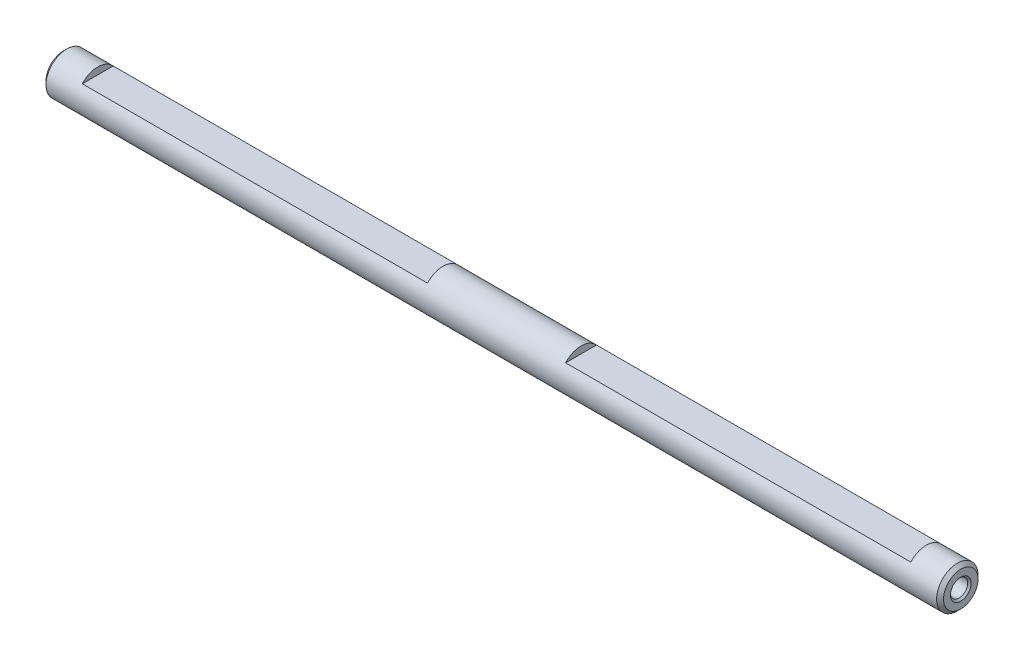
ISO-10303-21;
HEADER;
FILE_DESCRIPTION(('STEP AP214'),'2;1');
FILE_NAME('part.step','',(''),(''),'','','');
FILE_SCHEMA(('AUTOMOTIVE_DESIGN { 1 0 10303 214 1 1 1 1 }'));
ENDSEC;
DATA;
#1=APPLICATION_CONTEXT('core data for automotive mechanical design processes');
#2=APPLICATION_PROTOCOL_DEFINITION('international standard','automotive_design',2000,#1);
#3=PRODUCT_CONTEXT('',#1,'mechanical');
#4=PRODUCT('Part','Part','',(#3));
#5=PRODUCT_RELATED_PRODUCT_CATEGORY('part','',(#4));
#6=PRODUCT_DEFINITION_FORMATION('','',#4);
#7=PRODUCT_DEFINITION_CONTEXT('part definition',#1,'design');
#8=PRODUCT_DEFINITION('design','',#6,#7);
#9=PRODUCT_DEFINITION_SHAPE('','',#8);
#10=(LENGTH_UNIT() NAMED_UNIT(*) SI_UNIT(.MILLI.,.METRE.));
#11=(NAMED_UNIT(*) PLANE_ANGLE_UNIT() SI_UNIT($,.RADIAN.));
#12=(NAMED_UNIT(*) SI_UNIT($,.STERADIAN.) SOLID_ANGLE_UNIT());
#13=UNCERTAINTY_MEASURE_WITH_UNIT(LENGTH_MEASURE(1.E-05),#10,'distance_accuracy_value','');
#14=(GEOMETRIC_REPRESENTATION_CONTEXT(3) GLOBAL_UNCERTAINTY_ASSIGNED_CONTEXT((#13)) GLOBAL_UNIT_ASSIGNED_CONTEXT((#10,
#11,#12)) REPRESENTATION_CONTEXT('',''));
#15=CARTESIAN_POINT('',(0.,0.,0.));
#16=DIRECTION('',(0.,0.,1.));
#17=DIRECTION('',(1.,0.,0.));
#18=AXIS2_PLACEMENT_3D('',#15,#16,#17);
#19=CARTESIAN_POINT('',(123.250000000041,0.,0.));
#20=DIRECTION('',(1.,0.,0.));
#21=DIRECTION('',(0.,0.,-1.));
#22=AXIS2_PLACEMENT_3D('',#19,#20,#21);
#23=CONICAL_SURFACE('',#22,1.25000000002728,1.02974425866186);
#24=CARTESIAN_POINT('',(122.498924226221,0.,1.4210854715202E-10));
#25=VERTEX_POINT('',#24);
#26=VERTEX_LOOP('',#25);
#27=FACE_BOUND('',#26,.T.);
#28=CARTESIAN_POINT('',(123.25,0.,0.));
#29=DIRECTION('',(1.,0.,0.));
#30=DIRECTION('',(0.,0.,-1.));
#31=AXIS2_PLACEMENT_3D('',#28,#29,#30);
#32=CIRCLE('',#31,1.25);
#33=CARTESIAN_POINT('',(123.25,0.,-1.25));
#34=VERTEX_POINT('',#33);
#35=EDGE_CURVE('E83',#34,#34,#32,.T.);
#36=ORIENTED_EDGE('',*,*,#35,.T.);
#37=EDGE_LOOP('',(#36));
#38=FACE_BOUND('',#37,.T.);
#39=ADVANCED_FACE('F19',(#27,#38),#23,.F.);
#40=CARTESIAN_POINT('',(6.75000000001091,0.,0.));
#41=DIRECTION('',(-1.,0.,0.));
#42=DIRECTION('',(0.,0.,1.));
#43=AXIS2_PLACEMENT_3D('',#40,#41,#42);
#44=CONICAL_SURFACE('',#43,1.24999999997044,1.02974425864179);
#45=CARTESIAN_POINT('',(7.50107577380277,0.,0.));
#46=VERTEX_POINT('',#45);
#47=VERTEX_LOOP('',#46);
#48=FACE_BOUND('',#47,.T.);
#49=CARTESIAN_POINT('',(6.75,0.,0.));
#50=DIRECTION('',(-1.,0.,0.));
#51=DIRECTION('',(0.,0.,1.));
#52=AXIS2_PLACEMENT_3D('',#49,#50,#51);
#53=CIRCLE('',#52,1.25);
#54=CARTESIAN_POINT('',(6.75,0.,1.25));
#55=VERTEX_POINT('',#54);
#56=EDGE_CURVE('E86',#55,#55,#53,.T.);
#57=ORIENTED_EDGE('',*,*,#56,.T.);
#58=EDGE_LOOP('',(#57));
#59=FACE_BOUND('',#58,.T.);
#60=ADVANCED_FACE('F80',(#48,#59),#44,.F.);
#61=CARTESIAN_POINT('',(130.,0.,0.));
#62=DIRECTION('',(1.,0.,0.));
#63=DIRECTION('',(0.,0.,-1.));
#64=AXIS2_PLACEMENT_3D('',#61,#62,#63);
#65=CYLINDRICAL_SURFACE('',#64,1.25);
#66=ORIENTED_EDGE('',*,*,#35,.F.);
#67=EDGE_LOOP('',(#66));
#68=FACE_BOUND('',#67,.T.);
#69=CARTESIAN_POINT('',(129.749999999945,0.,0.));
#70=DIRECTION('',(1.,0.,0.));
#71=DIRECTION('',(0.,0.,-1.));
#72=AXIS2_PLACEMENT_3D('',#69,#70,#71);
#73=CIRCLE('',#72,1.25000000002728);
#74=CARTESIAN_POINT('',(129.749999999945,0.,-1.25000000002728));
#75=VERTEX_POINT('',#74);
#76=EDGE_CURVE('E94',#75,#75,#73,.T.);
#77=ORIENTED_EDGE('',*,*,#76,.T.);
#78=EDGE_LOOP('',(#77));
#79=FACE_BOUND('',#78,.T.);
#80=ADVANCED_FACE('F163',(#68,#79),#65,.F.);
#81=CARTESIAN_POINT('',(0.,0.,0.));
#82=DIRECTION('',(-1.,0.,0.));
#83=DIRECTION('',(0.,0.,1.));
#84=AXIS2_PLACEMENT_3D('',#81,#82,#83);
#85=CYLINDRICAL_SURFACE('',#84,1.25);
#86=ORIENTED_EDGE('',*,*,#56,.F.);
#87=EDGE_LOOP('',(#86));
#88=FACE_BOUND('',#87,.T.);
#89=CARTESIAN_POINT('',(0.249999999994088,0.,0.));
#90=DIRECTION('',(-1.,0.,0.));
#91=DIRECTION('',(0.,0.,1.));
#92=AXIS2_PLACEMENT_3D('',#89,#90,#91);
#93=CIRCLE('',#92,1.25000000002728);
#94=CARTESIAN_POINT('',(0.249999999994088,0.,1.25000000002728));
#95=VERTEX_POINT('',#94);
#96=EDGE_CURVE('E155',#95,#95,#93,.T.);
#97=ORIENTED_EDGE('',*,*,#96,.T.);
#98=EDGE_LOOP('',(#97));
#99=FACE_BOUND('',#98,.T.);
#100=ADVANCED_FACE('F169',(#88,#99),#85,.F.);
#101=CARTESIAN_POINT('',(129.999999999939,0.,0.));
#102=DIRECTION('',(1.,0.,0.));
#103=DIRECTION('',(0.,0.,-1.));
#104=AXIS2_PLACEMENT_3D('',#101,#102,#103);
#105=CONICAL_SURFACE('',#104,1.50000000002137,0.785398163397448);
#106=ORIENTED_EDGE('',*,*,#76,.F.);
#107=EDGE_LOOP('',(#106));
#108=FACE_BOUND('',#107,.T.);
#109=CARTESIAN_POINT('',(129.999999999939,0.,0.));
#110=DIRECTION('',(1.,0.,0.));
#111=DIRECTION('',(0.,0.,-1.));
#112=AXIS2_PLACEMENT_3D('',#109,#110,#111);
#113=CIRCLE('',#112,1.50000000002137);
#114=CARTESIAN_POINT('',(129.999999999939,0.,-1.50000000002137));
#115=VERTEX_POINT('',#114);
#116=EDGE_CURVE('E22',#115,#115,#113,.T.);
#117=ORIENTED_EDGE('',*,*,#116,.T.);
#118=EDGE_LOOP('',(#117));
#119=FACE_BOUND('',#118,.T.);
#120=ADVANCED_FACE('F165',(#108,#119),#105,.F.);
#121=CARTESIAN_POINT('',(5.6843418860808E-11,0.,0.));
#122=DIRECTION('',(-1.,0.,0.));
#123=DIRECTION('',(0.,0.,1.));
#124=AXIS2_PLACEMENT_3D('',#121,#122,#123);
#125=CONICAL_SURFACE('',#124,1.49999999990769,0.785398163283761);
#126=ORIENTED_EDGE('',*,*,#96,.F.);
#127=EDGE_LOOP('',(#126));
#128=FACE_BOUND('',#127,.T.);
#129=CARTESIAN_POINT('',(5.6843418860808E-11,0.,0.));
#130=DIRECTION('',(-1.,0.,0.));
#131=DIRECTION('',(0.,0.,1.));
#132=AXIS2_PLACEMENT_3D('',#129,#130,#131);
#133=CIRCLE('',#132,1.49999999990769);
#134=CARTESIAN_POINT('',(5.6843418860808E-11,0.,1.49999999990769));
#135=VERTEX_POINT('',#134);
#136=EDGE_CURVE('E123',#135,#135,#133,.T.);
#137=ORIENTED_EDGE('',*,*,#136,.T.);
#138=EDGE_LOOP('',(#137));
#139=FACE_BOUND('',#138,.T.);
#140=ADVANCED_FACE('F168',(#128,#139),#125,.F.);
#141=CARTESIAN_POINT('',(130.,2.5,0.));
#142=DIRECTION('',(-1.,0.,0.));
#143=DIRECTION('',(0.,0.,1.));
#144=AXIS2_PLACEMENT_3D('',#141,#142,#143);
#145=PLANE('',#144);
#146=ORIENTED_EDGE('',*,*,#116,.F.);
#147=EDGE_LOOP('',(#146));
#148=FACE_BOUND('',#147,.T.);
#149=CARTESIAN_POINT('',(129.999999999995,0.,0.));
#150=DIRECTION('',(-1.,0.,0.));
#151=DIRECTION('',(0.,0.,1.));
#152=AXIS2_PLACEMENT_3D('',#149,#150,#151);
#153=CIRCLE('',#152,2.49999999988404);
#154=CARTESIAN_POINT('',(129.999999999995,0.,2.49999999988404));
#155=VERTEX_POINT('',#154);
#156=EDGE_CURVE('E120',#155,#155,#153,.T.);
#157=ORIENTED_EDGE('',*,*,#156,.F.);
#158=EDGE_LOOP('',(#157));
#159=FACE_BOUND('',#158,.T.);
#160=ADVANCED_FACE('F297',(#148,#159),#145,.F.);
#161=CARTESIAN_POINT('',(125.,2.,6.));
#162=DIRECTION('',(-1.,0.,0.));
#163=DIRECTION('',(0.,0.,1.));
#164=AXIS2_PLACEMENT_3D('',#161,#162,#163);
#165=PLANE('',#164);
#166=DIRECTION('',(0.,0.,1.));
#167=VECTOR('',#166,1.);
#168=CARTESIAN_POINT('',(125.,2.,6.));
#169=LINE('',#168,#167);
#170=CARTESIAN_POINT('',(125.,1.99999999999995,2.23606797749984));
#171=VERTEX_POINT('',#170);
#172=CARTESIAN_POINT('',(125.,1.99999999999995,-2.23606797749984));
#173=VERTEX_POINT('',#172);
#174=EDGE_CURVE('E137',#171,#173,#169,.F.);
#175=ORIENTED_EDGE('',*,*,#174,.F.);
#176=CARTESIAN_POINT('',(125.,0.,0.));
#177=DIRECTION('',(-1.,0.,0.));
#178=DIRECTION('',(0.,0.,1.));
#179=AXIS2_PLACEMENT_3D('',#176,#177,#178);
#180=CIRCLE('',#179,3.);
#181=EDGE_CURVE('E69',#173,#171,#180,.F.);
#182=ORIENTED_EDGE('',*,*,#181,.F.);
#183=EDGE_LOOP('',(#175,#182));
#184=FACE_BOUND('',#183,.T.);
#185=ADVANCED_FACE('F291',(#184),#165,.T.);
#186=CARTESIAN_POINT('',(75.,3.,6.));
#187=DIRECTION('',(1.,0.,0.));
#188=DIRECTION('',(0.,0.,-1.));
#189=AXIS2_PLACEMENT_3D('',#186,#187,#188);
#190=PLANE('',#189);
#191=DIRECTION('',(0.,0.,1.));
#192=VECTOR('',#191,1.);
#193=CARTESIAN_POINT('',(75.,2.,6.));
#194=LINE('',#193,#192);
#195=CARTESIAN_POINT('',(75.,1.99999999999995,-2.23606797749984));
#196=VERTEX_POINT('',#195);
#197=CARTESIAN_POINT('',(75.,1.99999999999995,2.23606797749984));
#198=VERTEX_POINT('',#197);
#199=EDGE_CURVE('E147',#196,#198,#194,.T.);
#200=ORIENTED_EDGE('',*,*,#199,.F.);
#201=CARTESIAN_POINT('',(75.,0.,0.));
#202=DIRECTION('',(-1.,0.,0.));
#203=DIRECTION('',(0.,0.,1.));
#204=AXIS2_PLACEMENT_3D('',#201,#202,#203);
#205=CIRCLE('',#204,3.);
#206=EDGE_CURVE('E113',#198,#196,#205,.T.);
#207=ORIENTED_EDGE('',*,*,#206,.F.);
#208=EDGE_LOOP('',(#200,#207));
#209=FACE_BOUND('',#208,.T.);
#210=ADVANCED_FACE('F269',(#209),#190,.T.);
#211=CARTESIAN_POINT('',(75.,2.,6.));
#212=DIRECTION('',(0.,1.,0.));
#213=DIRECTION('',(0.,0.,1.));
#214=AXIS2_PLACEMENT_3D('',#211,#212,#213);
#215=PLANE('',#214);
#216=DIRECTION('',(-1.,0.,0.));
#217=VECTOR('',#216,1.);
#218=CARTESIAN_POINT('',(130.,1.9999999999999,2.23606797749988));
#219=LINE('',#218,#217);
#220=EDGE_CURVE('E117',#171,#198,#219,.T.);
#221=ORIENTED_EDGE('',*,*,#220,.F.);
#222=ORIENTED_EDGE('',*,*,#174,.T.);
#223=DIRECTION('',(-1.,0.,0.));
#224=VECTOR('',#223,1.);
#225=CARTESIAN_POINT('',(130.,1.9999999999999,-2.23606797749988));
#226=LINE('',#225,#224);
#227=EDGE_CURVE('E112',#196,#173,#226,.F.);
#228=ORIENTED_EDGE('',*,*,#227,.F.);
#229=ORIENTED_EDGE('',*,*,#199,.T.);
#230=EDGE_LOOP('',(#221,#222,#228,#229));
#231=FACE_BOUND('',#230,.T.);
#232=ADVANCED_FACE('F216',(#231),#215,.T.);
#233=CARTESIAN_POINT('',(55.,2.,6.));
#234=DIRECTION('',(-1.,0.,0.));
#235=DIRECTION('',(0.,0.,1.));
#236=AXIS2_PLACEMENT_3D('',#233,#234,#235);
#237=PLANE('',#236);
#238=DIRECTION('',(0.,0.,1.));
#239=VECTOR('',#238,1.);
#240=CARTESIAN_POINT('',(55.,2.,6.));
#241=LINE('',#240,#239);
#242=CARTESIAN_POINT('',(55.,1.99999999999995,2.23606797749984));
#243=VERTEX_POINT('',#242);
#244=CARTESIAN_POINT('',(55.,1.99999999999995,-2.23606797749984));
#245=VERTEX_POINT('',#244);
#246=EDGE_CURVE('E126',#243,#245,#241,.F.);
#247=ORIENTED_EDGE('',*,*,#246,.F.);
#248=CARTESIAN_POINT('',(55.,0.,0.));
#249=DIRECTION('',(-1.,0.,0.));
#250=DIRECTION('',(0.,0.,1.));
#251=AXIS2_PLACEMENT_3D('',#248,#249,#250);
#252=CIRCLE('',#251,3.);
#253=EDGE_CURVE('E108',#245,#243,#252,.F.);
#254=ORIENTED_EDGE('',*,*,#253,.F.);
#255=EDGE_LOOP('',(#247,#254));
#256=FACE_BOUND('',#255,.T.);
#257=ADVANCED_FACE('F207',(#256),#237,.T.);
#258=CARTESIAN_POINT('',(5.,5.,6.));
#259=DIRECTION('',(1.,0.,0.));
#260=DIRECTION('',(0.,0.,-1.));
#261=AXIS2_PLACEMENT_3D('',#258,#259,#260);
#262=PLANE('',#261);
#263=DIRECTION('',(0.,0.,1.));
#264=VECTOR('',#263,1.);
#265=CARTESIAN_POINT('',(5.,2.,6.));
#266=LINE('',#265,#264);
#267=CARTESIAN_POINT('',(5.,1.99999999999995,-2.23606797749984));
#268=VERTEX_POINT('',#267);
#269=CARTESIAN_POINT('',(5.,1.99999999999995,2.23606797749984));
#270=VERTEX_POINT('',#269);
#271=EDGE_CURVE('E41',#268,#270,#266,.T.);
#272=ORIENTED_EDGE('',*,*,#271,.F.);
#273=CARTESIAN_POINT('',(5.,0.,0.));
#274=DIRECTION('',(-1.,0.,0.));
#275=DIRECTION('',(0.,0.,1.));
#276=AXIS2_PLACEMENT_3D('',#273,#274,#275);
#277=CIRCLE('',#276,3.);
#278=EDGE_CURVE('E103',#270,#268,#277,.T.);
#279=ORIENTED_EDGE('',*,*,#278,.F.);
#280=EDGE_LOOP('',(#272,#279));
#281=FACE_BOUND('',#280,.T.);
#282=ADVANCED_FACE('F205',(#281),#262,.T.);
#283=CARTESIAN_POINT('',(75.,2.,6.));
#284=DIRECTION('',(0.,1.,0.));
#285=DIRECTION('',(0.,0.,1.));
#286=AXIS2_PLACEMENT_3D('',#283,#284,#285);
#287=PLANE('',#286);
#288=DIRECTION('',(-1.,0.,0.));
#289=VECTOR('',#288,1.);
#290=CARTESIAN_POINT('',(130.,1.9999999999999,2.23606797749988));
#291=LINE('',#290,#289);
#292=EDGE_CURVE('E107',#243,#270,#291,.T.);
#293=ORIENTED_EDGE('',*,*,#292,.F.);
#294=ORIENTED_EDGE('',*,*,#246,.T.);
#295=DIRECTION('',(-1.,0.,0.));
#296=VECTOR('',#295,1.);
#297=CARTESIAN_POINT('',(130.,1.9999999999999,-2.23606797749988));
#298=LINE('',#297,#296);
#299=EDGE_CURVE('E102',#268,#245,#298,.F.);
#300=ORIENTED_EDGE('',*,*,#299,.F.);
#301=ORIENTED_EDGE('',*,*,#271,.T.);
#302=EDGE_LOOP('',(#293,#294,#300,#301));
#303=FACE_BOUND('',#302,.T.);
#304=ADVANCED_FACE('F204',(#303),#287,.T.);
#305=CARTESIAN_POINT('',(0.,0.,0.));
#306=DIRECTION('',(1.,0.,0.));
#307=DIRECTION('',(0.,0.,-1.));
#308=AXIS2_PLACEMENT_3D('',#305,#306,#307);
#309=PLANE('',#308);
#310=ORIENTED_EDGE('',*,*,#136,.F.);
#311=EDGE_LOOP('',(#310));
#312=FACE_BOUND('',#311,.T.);
#313=CARTESIAN_POINT('',(0.,0.,0.));
#314=DIRECTION('',(1.,0.,0.));
#315=DIRECTION('',(0.,0.,-1.));
#316=AXIS2_PLACEMENT_3D('',#313,#314,#315);
#317=CIRCLE('',#316,2.49999999999773);
#318=CARTESIAN_POINT('',(0.,0.,-2.49999999999773));
#319=VERTEX_POINT('',#318);
#320=EDGE_CURVE('E98',#319,#319,#317,.T.);
#321=ORIENTED_EDGE('',*,*,#320,.F.);
#322=EDGE_LOOP('',(#321));
#323=FACE_BOUND('',#322,.T.);
#324=ADVANCED_FACE('F214',(#312,#323),#309,.F.);
#325=CARTESIAN_POINT('',(129.500000000007,0.,0.));
#326=DIRECTION('',(-1.,0.,0.));
#327=DIRECTION('',(0.,0.,1.));
#328=AXIS2_PLACEMENT_3D('',#325,#326,#327);
#329=CONICAL_SURFACE('',#328,2.99999999987222,0.785398163397448);
#330=ORIENTED_EDGE('',*,*,#156,.T.);
#331=EDGE_LOOP('',(#330));
#332=FACE_BOUND('',#331,.T.);
#333=CARTESIAN_POINT('',(129.5,0.,0.));
#334=DIRECTION('',(-1.,0.,0.));
#335=DIRECTION('',(0.,0.,1.));
#336=AXIS2_PLACEMENT_3D('',#333,#334,#335);
#337=CIRCLE('',#336,3.);
#338=CARTESIAN_POINT('',(129.5,0.,3.));
#339=VERTEX_POINT('',#338);
#340=EDGE_CURVE('E29',#339,#339,#337,.T.);
#341=ORIENTED_EDGE('',*,*,#340,.F.);
#342=EDGE_LOOP('',(#341));
#343=FACE_BOUND('',#342,.T.);
#344=ADVANCED_FACE('F226',(#332,#343),#329,.T.);
#345=CARTESIAN_POINT('',(0.499999999988177,0.,0.));
#346=DIRECTION('',(1.,0.,0.));
#347=DIRECTION('',(0.,0.,-1.));
#348=AXIS2_PLACEMENT_3D('',#345,#346,#347);
#349=CONICAL_SURFACE('',#348,3.00000000004275,0.785398163454292);
#350=CARTESIAN_POINT('',(0.5,0.,0.));
#351=DIRECTION('',(-1.,0.,0.));
#352=DIRECTION('',(0.,0.,1.));
#353=AXIS2_PLACEMENT_3D('',#350,#351,#352);
#354=CIRCLE('',#353,3.);
#355=CARTESIAN_POINT('',(0.5,0.,3.));
#356=VERTEX_POINT('',#355);
#357=EDGE_CURVE('E11',#356,#356,#354,.F.);
#358=ORIENTED_EDGE('',*,*,#357,.F.);
#359=EDGE_LOOP('',(#358));
#360=FACE_BOUND('',#359,.T.);
#361=ORIENTED_EDGE('',*,*,#320,.T.);
#362=EDGE_LOOP('',(#361));
#363=FACE_BOUND('',#362,.T.);
#364=ADVANCED_FACE('F220',(#360,#363),#349,.T.);
#365=CARTESIAN_POINT('',(130.,0.,0.));
#366=DIRECTION('',(-1.,0.,0.));
#367=DIRECTION('',(0.,0.,1.));
#368=AXIS2_PLACEMENT_3D('',#365,#366,#367);
#369=CYLINDRICAL_SURFACE('',#368,3.);
#370=ORIENTED_EDGE('',*,*,#340,.T.);
#371=EDGE_LOOP('',(#370));
#372=FACE_BOUND('',#371,.T.);
#373=ORIENTED_EDGE('',*,*,#357,.T.);
#374=EDGE_LOOP('',(#373));
#375=FACE_BOUND('',#374,.T.);
#376=ORIENTED_EDGE('',*,*,#278,.T.);
#377=ORIENTED_EDGE('',*,*,#299,.T.);
#378=ORIENTED_EDGE('',*,*,#253,.T.);
#379=ORIENTED_EDGE('',*,*,#292,.T.);
#380=EDGE_LOOP('',(#376,#377,#378,#379));
#381=FACE_BOUND('',#380,.T.);
#382=ORIENTED_EDGE('',*,*,#206,.T.);
#383=ORIENTED_EDGE('',*,*,#227,.T.);
#384=ORIENTED_EDGE('',*,*,#181,.T.);
#385=ORIENTED_EDGE('',*,*,#220,.T.);
#386=EDGE_LOOP('',(#382,#383,#384,#385));
#387=FACE_BOUND('',#386,.T.);
#388=ADVANCED_FACE('F202',(#372,#375,#381,#387),#369,.T.);
#389=CLOSED_SHELL('',(#39,#60,#80,#100,#120,#140,#160,#185,#210,#232,#257,#282,#304,#324,#344,
#364,#388));
#390=MANIFOLD_SOLID_BREP('B1',#389);
#391=ADVANCED_BREP_SHAPE_REPRESENTATION('',(#18,#390),#14);
#392=SHAPE_DEFINITION_REPRESENTATION(#9,#391);
ENDSEC;
END-ISO-10303-21;
